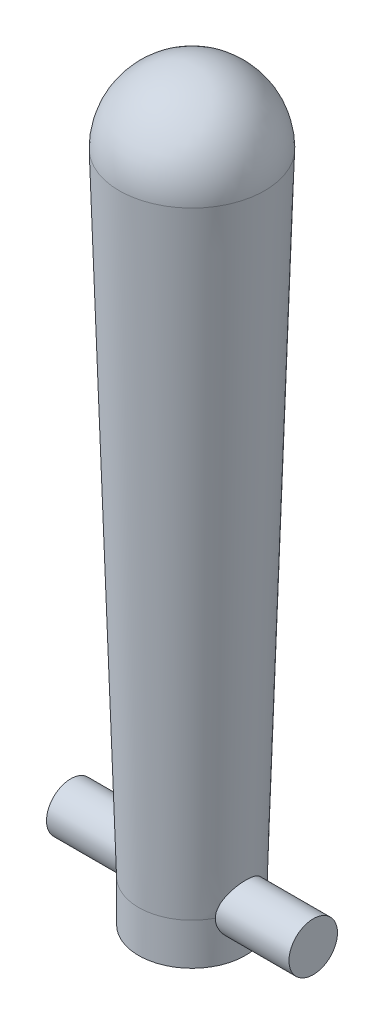
ISO-10303-21;
HEADER;
FILE_DESCRIPTION(('STEP AP214'),'2;1');
FILE_NAME('part.step','',(''),(''),'','','');
FILE_SCHEMA(('AUTOMOTIVE_DESIGN { 1 0 10303 214 1 1 1 1 }'));
ENDSEC;
DATA;
#1=APPLICATION_CONTEXT('core data for automotive mechanical design processes');
#2=APPLICATION_PROTOCOL_DEFINITION('international standard','automotive_design',2000,#1);
#3=PRODUCT_CONTEXT('',#1,'mechanical');
#4=PRODUCT('Part','Part','',(#3));
#5=PRODUCT_RELATED_PRODUCT_CATEGORY('part','',(#4));
#6=PRODUCT_DEFINITION_FORMATION('','',#4);
#7=PRODUCT_DEFINITION_CONTEXT('part definition',#1,'design');
#8=PRODUCT_DEFINITION('design','',#6,#7);
#9=PRODUCT_DEFINITION_SHAPE('','',#8);
#10=(LENGTH_UNIT() NAMED_UNIT(*) SI_UNIT(.MILLI.,.METRE.));
#11=(NAMED_UNIT(*) PLANE_ANGLE_UNIT() SI_UNIT($,.RADIAN.));
#12=(NAMED_UNIT(*) SI_UNIT($,.STERADIAN.) SOLID_ANGLE_UNIT());
#13=UNCERTAINTY_MEASURE_WITH_UNIT(LENGTH_MEASURE(1.E-05),#10,'distance_accuracy_value','');
#14=(GEOMETRIC_REPRESENTATION_CONTEXT(3) GLOBAL_UNCERTAINTY_ASSIGNED_CONTEXT((#13)) GLOBAL_UNIT_ASSIGNED_CONTEXT((#10,
#11,#12)) REPRESENTATION_CONTEXT('',''));
#15=CARTESIAN_POINT('',(0.,0.,0.));
#16=DIRECTION('',(0.,0.,1.));
#17=DIRECTION('',(1.,0.,0.));
#18=AXIS2_PLACEMENT_3D('',#15,#16,#17);
#19=CARTESIAN_POINT('',(-6.22505877631642E-08,10.9185095584337,7.81017844711732E-08));
#20=DIRECTION('',(0.,1.,0.));
#21=DIRECTION('',(0.,0.,1.));
#22=AXIS2_PLACEMENT_3D('',#19,#20,#21);
#23=CONICAL_SURFACE('',#22,0.960225,0.0307595260704692);
#24=CARTESIAN_POINT('',(-6.22505877631642E-08,2.59655955843367,7.81017844711732E-08));
#25=DIRECTION('',(0.,-1.,0.));
#26=DIRECTION('',(0.,0.,-1.));
#27=AXIS2_PLACEMENT_3D('',#24,#25,#26);
#28=CIRCLE('',#27,0.704165);
#29=CARTESIAN_POINT('',(0.627216281286473,2.59655955843367,0.320075078101784));
#30=VERTEX_POINT('',#29);
#31=CARTESIAN_POINT('',(-0.627216405787648,2.59655955843367,0.320075078101784));
#32=VERTEX_POINT('',#31);
#33=EDGE_CURVE('E78',#30,#32,#28,.T.);
#34=ORIENTED_EDGE('',*,*,#33,.F.);
#35=CARTESIAN_POINT('',(0.627211871671005,2.59643152843367,0.320075052495783));
#36=CARTESIAN_POINT('',(0.627774260262814,2.61363465105871,0.320099552192788));
#37=CARTESIAN_POINT('',(0.629098649276304,2.63077906961744,0.318703553345958));
#38=CARTESIAN_POINT('',(0.632992881290255,2.66440966394063,0.3132569308774));
#39=CARTESIAN_POINT('',(0.6355563517057,2.68089874556348,0.309219853156604));
#40=CARTESIAN_POINT('',(0.641655637089719,2.71283195187365,0.298684088615112));
#41=CARTESIAN_POINT('',(0.645189606088225,2.72827799171024,0.292190066340817));
#42=CARTESIAN_POINT('',(0.652865116590407,2.75787300794719,0.276953603035148));
#43=CARTESIAN_POINT('',(0.657007482598257,2.77202018115153,0.268208098474659));
#44=CARTESIAN_POINT('',(0.665835773717179,2.79973277554323,0.247960557265956));
#45=CARTESIAN_POINT('',(0.670539281227394,2.81317937673072,0.236303363146492));
#46=CARTESIAN_POINT('',(0.679760961910614,2.837993430705,0.210886729318048));
#47=CARTESIAN_POINT('',(0.684279102294035,2.84936051686603,0.197126919693922));
#48=CARTESIAN_POINT('',(0.692887052564143,2.87016319533712,0.167140717043652));
#49=CARTESIAN_POINT('',(0.696949981974717,2.87949433035392,0.150833533178759));
#50=CARTESIAN_POINT('',(0.703969785723909,2.89521771887439,0.116639396022319));
#51=CARTESIAN_POINT('',(0.706927369323864,2.90161185755022,0.0987534648978867));
#52=CARTESIAN_POINT('',(0.711227918885548,2.910803772369,0.0633139510704268));
#53=CARTESIAN_POINT('',(0.712673616046592,2.9138314158939,0.0458326320356412));
#54=CARTESIAN_POINT('',(0.714162912113332,2.91694953406082,0.0105537770509313));
#55=CARTESIAN_POINT('',(0.714207200699864,2.91704145347276,-0.00724359904143412));
#56=CARTESIAN_POINT('',(0.712941544185585,2.91439287449274,-0.0412068880387886));
#57=CARTESIAN_POINT('',(0.711734201579422,2.91186697620494,-0.0573940450251657));
#58=CARTESIAN_POINT('',(0.708235167080418,2.90441880332078,-0.0890821895783392));
#59=CARTESIAN_POINT('',(0.705943400659326,2.89949636401876,-0.104583129904038));
#60=CARTESIAN_POINT('',(0.700424851688911,2.88732539974184,-0.134810298937162));
#61=CARTESIAN_POINT('',(0.697181192990191,2.88003461210937,-0.149516311624252));
#62=CARTESIAN_POINT('',(0.690050065523073,2.86338467026965,-0.177533605587768));
#63=CARTESIAN_POINT('',(0.686162359077817,2.85402475205052,-0.190844368994942));
#64=CARTESIAN_POINT('',(0.677690828906097,2.83255013563128,-0.216948905545537));
#65=CARTESIAN_POINT('',(0.673075847429007,2.82026482366496,-0.229592344395767));
#66=CARTESIAN_POINT('',(0.663869909368219,2.79377632657206,-0.252710997931971));
#67=CARTESIAN_POINT('',(0.659278974428788,2.77957164707739,-0.263184506910181));
#68=CARTESIAN_POINT('',(0.650325248994902,2.74867726079237,-0.282233555562714));
#69=CARTESIAN_POINT('',(0.645989847759086,2.73189267985328,-0.29066907117176));
#70=CARTESIAN_POINT('',(0.638388394290289,2.6969122209401,-0.304514979207038));
#71=CARTESIAN_POINT('',(0.635120037291172,2.67871949114909,-0.309931909781299));
#72=CARTESIAN_POINT('',(0.631205278144744,2.64968457110141,-0.31581496207397));
#73=CARTESIAN_POINT('',(0.63003797606326,2.63913046999313,-0.317410726472569));
#74=CARTESIAN_POINT('',(0.628223365730673,2.61786762534993,-0.319543981359214));
#75=CARTESIAN_POINT('',(0.627576280210204,2.60715881757274,-0.320081018696193));
#76=CARTESIAN_POINT('',(0.627211871671005,2.59643152843367,-0.320074896292215));
#77=B_SPLINE_CURVE_WITH_KNOTS('',3,(#35,#36,#37,#38,#39,#40,#41,#42,#43,#44,#45,#46,#47,#48,#49,
#50,#51,#52,#53,#54,#55,#56,#57,#58,#59,#60,#61,#62,#63,#64,#65,#66,#67,#68,#69,#70,#71,#72,#73,
#74,#75,#76),.UNSPECIFIED.,.F.,.F.,(4,2,2,2,2,2,2,2,2,2,2,2,2,2,2,2,2,2,2,2,4),(0.,
0.0515129943056462,0.102763831996349,0.153917853518652,0.205141850195332,0.260123773753569,
0.315115381494372,0.372478908428164,0.429805563759261,0.482917037942269,0.53600237375521,
0.585055723864567,0.634112445710562,0.684097668854055,0.734101379609087,0.788536114558833,
0.843013477794551,0.900557396391122,0.957976187573991,0.99012929129155,1.02229615403462),.UNSPECIFIED.);
#78=CARTESIAN_POINT('',(0.627216281286473,2.59655955843367,-0.320074921898216));
#79=VERTEX_POINT('',#78);
#80=EDGE_CURVE('E63',#30,#79,#77,.T.);
#81=ORIENTED_EDGE('',*,*,#80,.T.);
#82=CARTESIAN_POINT('',(-0.627216405787648,2.59655955843367,-0.320074921898216));
#83=VERTEX_POINT('',#82);
#84=EDGE_CURVE('E77',#83,#79,#28,.T.);
#85=ORIENTED_EDGE('',*,*,#84,.F.);
#86=CARTESIAN_POINT('',(-0.62721199617218,2.59643152843367,-0.320074896292214));
#87=CARTESIAN_POINT('',(-0.627774384763989,2.61363465105871,-0.320099395989219));
#88=CARTESIAN_POINT('',(-0.629098773777479,2.63077906961744,-0.318703397142389));
#89=CARTESIAN_POINT('',(-0.632993005791431,2.66440966394063,-0.313256774673831));
#90=CARTESIAN_POINT('',(-0.635556476206876,2.68089874556348,-0.309219696953035));
#91=CARTESIAN_POINT('',(-0.641655761590895,2.71283195187365,-0.298683932411543));
#92=CARTESIAN_POINT('',(-0.6451897305894,2.72827799171024,-0.292189910137248));
#93=CARTESIAN_POINT('',(-0.652865241091582,2.75787300794719,-0.276953446831579));
#94=CARTESIAN_POINT('',(-0.657007607099433,2.77202018115153,-0.26820794227109));
#95=CARTESIAN_POINT('',(-0.665835898218355,2.79973277554323,-0.247960401062387));
#96=CARTESIAN_POINT('',(-0.67053940572857,2.81317937673072,-0.236303206942923));
#97=CARTESIAN_POINT('',(-0.679761086411789,2.837993430705,-0.210886573114479));
#98=CARTESIAN_POINT('',(-0.684279226795211,2.84936051686603,-0.197126763490353));
#99=CARTESIAN_POINT('',(-0.692887177065319,2.87016319533712,-0.167140560840083));
#100=CARTESIAN_POINT('',(-0.696950106475892,2.87949433035392,-0.15083337697519));
#101=CARTESIAN_POINT('',(-0.703969910225084,2.89521771887439,-0.116639239818751));
#102=CARTESIAN_POINT('',(-0.706927493825039,2.90161185755022,-0.0987533086943177));
#103=CARTESIAN_POINT('',(-0.711228043386724,2.910803772369,-0.0633137948668579));
#104=CARTESIAN_POINT('',(-0.712673740547768,2.9138314158939,-0.0458324758320723));
#105=CARTESIAN_POINT('',(-0.714163036614507,2.91694953406082,-0.0105536208473624));
#106=CARTESIAN_POINT('',(-0.71420732520104,2.91704145347276,0.00724375524500307));
#107=CARTESIAN_POINT('',(-0.712941668686761,2.91439287449274,0.0412070442423576));
#108=CARTESIAN_POINT('',(-0.711734326080598,2.91186697620494,0.0573942012287346));
#109=CARTESIAN_POINT('',(-0.708235291581594,2.90441880332078,0.0890823457819082));
#110=CARTESIAN_POINT('',(-0.705943525160501,2.89949636401876,0.104583286107607));
#111=CARTESIAN_POINT('',(-0.700424976190086,2.88732539974184,0.134810455140731));
#112=CARTESIAN_POINT('',(-0.697181317491366,2.88003461210937,0.149516467827821));
#113=CARTESIAN_POINT('',(-0.690050190024248,2.86338467026965,0.177533761791337));
#114=CARTESIAN_POINT('',(-0.686162483578992,2.85402475205052,0.190844525198511));
#115=CARTESIAN_POINT('',(-0.677690953407273,2.83255013563128,0.216949061749106));
#116=CARTESIAN_POINT('',(-0.673075971930182,2.82026482366496,0.229592500599336));
#117=CARTESIAN_POINT('',(-0.663870033869394,2.79377632657206,0.25271115413554));
#118=CARTESIAN_POINT('',(-0.659279098929964,2.77957164707739,0.26318466311375));
#119=CARTESIAN_POINT('',(-0.650325373496077,2.74867726079237,0.282233711766283));
#120=CARTESIAN_POINT('',(-0.645989972260261,2.73189267985328,0.290669227375329));
#121=CARTESIAN_POINT('',(-0.638388518791465,2.6969122209401,0.304515135410607));
#122=CARTESIAN_POINT('',(-0.635120161792348,2.67871949114909,0.309932065984868));
#123=CARTESIAN_POINT('',(-0.631205402645919,2.64968457110141,0.315815118277539));
#124=CARTESIAN_POINT('',(-0.630038100564436,2.63913046999313,0.317410882676138));
#125=CARTESIAN_POINT('',(-0.628223490231848,2.61786762534993,0.319544137562783));
#126=CARTESIAN_POINT('',(-0.627576404711379,2.60715881757274,0.320081174899762));
#127=CARTESIAN_POINT('',(-0.62721199617218,2.59643152843367,0.320075052495783));
#128=B_SPLINE_CURVE_WITH_KNOTS('',3,(#86,#87,#88,#89,#90,#91,#92,#93,#94,#95,#96,#97,#98,#99,
#100,#101,#102,#103,#104,#105,#106,#107,#108,#109,#110,#111,#112,#113,#114,#115,#116,#117,#118,
#119,#120,#121,#122,#123,#124,#125,#126,#127),.UNSPECIFIED.,.F.,.F.,(4,2,2,2,2,2,2,2,2,2,2,2,2,
2,2,2,2,2,2,2,4),(0.,0.0515129943056462,0.102763831996349,0.153917853518652,0.205141850195333,
0.260123773753569,0.315115381494372,0.372478908428164,0.429805563759261,0.482917037942269,
0.53600237375521,0.585055723864567,0.634112445710561,0.684097668854055,0.734101379609087,
0.788536114558833,0.843013477794551,0.900557396391123,0.957976187573991,0.990129291291551,
1.02229615403462),.UNSPECIFIED.);
#129=EDGE_CURVE('E57',#83,#32,#128,.T.);
#130=ORIENTED_EDGE('',*,*,#129,.T.);
#131=EDGE_LOOP('',(#34,#81,#85,#130));
#132=FACE_BOUND('',#131,.T.);
#133=CARTESIAN_POINT('',(-6.22505877631642E-08,10.9185095584337,7.81017844711732E-08));
#134=DIRECTION('',(0.,-1.,0.));
#135=DIRECTION('',(0.,0.,-1.));
#136=AXIS2_PLACEMENT_3D('',#133,#134,#135);
#137=CIRCLE('',#136,0.960225);
#138=CARTESIAN_POINT('',(-6.22505877631642E-08,10.9185095584337,-0.960224921898215));
#139=VERTEX_POINT('',#138);
#140=EDGE_CURVE('E73',#139,#139,#137,.T.);
#141=ORIENTED_EDGE('',*,*,#140,.T.);
#142=EDGE_LOOP('',(#141));
#143=FACE_BOUND('',#142,.T.);
#144=ADVANCED_FACE('F38',(#132,#143),#23,.T.);
#145=CARTESIAN_POINT('',(-6.22505877631642E-08,10.9185095584337,7.81017844711732E-08));
#146=DIRECTION('',(0.,-1.,0.));
#147=DIRECTION('',(0.,0.,-1.));
#148=AXIS2_PLACEMENT_3D('',#145,#146,#147);
#149=SPHERICAL_SURFACE('',#148,0.960225);
#150=ORIENTED_EDGE('',*,*,#140,.F.);
#151=EDGE_LOOP('',(#150));
#152=FACE_BOUND('',#151,.T.);
#153=ADVANCED_FACE('F126',(#152),#149,.T.);
#154=CARTESIAN_POINT('',(-6.22505877631642E-08,2.04741952973679,7.81017844711732E-08));
#155=DIRECTION('',(0.,1.,0.));
#156=DIRECTION('',(0.,0.,1.));
#157=AXIS2_PLACEMENT_3D('',#154,#155,#156);
#158=PLANE('',#157);
#159=CARTESIAN_POINT('',(-6.22505877631642E-08,2.04741952973679,7.81017844711732E-08));
#160=DIRECTION('',(0.,-1.,0.));
#161=DIRECTION('',(0.,0.,-1.));
#162=AXIS2_PLACEMENT_3D('',#159,#160,#161);
#163=CIRCLE('',#162,0.704165);
#164=CARTESIAN_POINT('',(-6.22505877631642E-08,2.04741952973679,-0.704164921898216));
#165=VERTEX_POINT('',#164);
#166=EDGE_CURVE('E83',#165,#165,#163,.T.);
#167=ORIENTED_EDGE('',*,*,#166,.T.);
#168=EDGE_LOOP('',(#167));
#169=FACE_BOUND('',#168,.T.);
#170=ADVANCED_FACE('F130',(#169),#158,.F.);
#171=CARTESIAN_POINT('',(-6.22505877631642E-08,2.59655955843367,7.81017844711732E-08));
#172=DIRECTION('',(0.,-1.,0.));
#173=DIRECTION('',(0.,0.,-1.));
#174=AXIS2_PLACEMENT_3D('',#171,#172,#173);
#175=CYLINDRICAL_SURFACE('',#174,0.704165);
#176=ORIENTED_EDGE('',*,*,#166,.F.);
#177=EDGE_LOOP('',(#176));
#178=FACE_BOUND('',#177,.T.);
#179=ORIENTED_EDGE('',*,*,#33,.T.);
#180=CARTESIAN_POINT('',(-0.627216405787648,2.59655955843367,-0.320074921898216));
#181=CARTESIAN_POINT('',(-0.627218648572462,2.61346526175109,-0.32007275974522));
#182=CARTESIAN_POINT('',(-0.627909962073387,2.63039112163022,-0.318727150124534));
#183=CARTESIAN_POINT('',(-0.630583561106963,2.66374421927839,-0.313402230274501));
#184=CARTESIAN_POINT('',(-0.632569026032251,2.68017012448957,-0.309416433400727));
#185=CARTESIAN_POINT('',(-0.637554353522433,2.71197592411691,-0.299007858517528));
#186=CARTESIAN_POINT('',(-0.640549537931007,2.72736025652369,-0.292596302893692));
#187=CARTESIAN_POINT('',(-0.647210089349772,2.75683130823579,-0.277551637916824));
#188=CARTESIAN_POINT('',(-0.650875385367387,2.77091816476003,-0.268918763853988));
#189=CARTESIAN_POINT('',(-0.658767232549814,2.79844935254623,-0.2489907149089));
#190=CARTESIAN_POINT('',(-0.663014972047232,2.81178599121482,-0.237555086586052));
#191=CARTESIAN_POINT('',(-0.67142052750926,2.8364335584733,-0.212639846767605));
#192=CARTESIAN_POINT('',(-0.675578304067077,2.84774361453756,-0.199159359467857));
#193=CARTESIAN_POINT('',(-0.683601508636945,2.86860425054998,-0.169655554015999));
#194=CARTESIAN_POINT('',(-0.687439497490303,2.87802873763064,-0.153534931691296));
#195=CARTESIAN_POINT('',(-0.694124719164096,2.89398412946575,-0.119730440417821));
#196=CARTESIAN_POINT('',(-0.696972471262083,2.90051655130411,-0.102047396918611));
#197=CARTESIAN_POINT('',(-0.701205110126104,2.91009662133226,-0.0667553435082816));
#198=CARTESIAN_POINT('',(-0.702668131576687,2.91333132010413,-0.0492066802331819));
#199=CARTESIAN_POINT('',(-0.704253701724381,2.91683357856047,-0.0137589857308948));
#200=CARTESIAN_POINT('',(-0.704376905774988,2.91710258887209,0.00413986991187788));
#201=CARTESIAN_POINT('',(-0.703311149308117,2.91475277005711,0.0384001367074892));
#202=CARTESIAN_POINT('',(-0.702216256486469,2.91234097824565,0.0547792704027349));
#203=CARTESIAN_POINT('',(-0.69897220600413,2.90505963930326,0.0868705607719003));
#204=CARTESIAN_POINT('',(-0.696822970169304,2.90018990992808,0.102582667895342));
#205=CARTESIAN_POINT('',(-0.691632188142397,2.88808130376414,0.133184470113301));
#206=CARTESIAN_POINT('',(-0.688577632460642,2.88080769430825,0.148058124044225));
#207=CARTESIAN_POINT('',(-0.681864841131401,2.86413645435912,0.176412611660638));
#208=CARTESIAN_POINT('',(-0.678206384505963,2.85473804589762,0.189892932553968));
#209=CARTESIAN_POINT('',(-0.670290689987765,2.83319747000346,0.216248243835898));
#210=CARTESIAN_POINT('',(-0.6660089517247,2.82089407084774,0.228984263075549));
#211=CARTESIAN_POINT('',(-0.657539039280084,2.79433591791504,0.252279266493828));
#212=CARTESIAN_POINT('',(-0.653350916974307,2.78008011196891,0.262837069070236));
#213=CARTESIAN_POINT('',(-0.645348025989356,2.7492199827287,0.281933678455032));
#214=CARTESIAN_POINT('',(-0.641558696897339,2.73253862106137,0.290359626978342));
#215=CARTESIAN_POINT('',(-0.635102600685578,2.69777743129452,0.304224112486146));
#216=CARTESIAN_POINT('',(-0.632434858016001,2.67969883477546,0.309665246906835));
#217=CARTESIAN_POINT('',(-0.628780574747675,2.64405146486967,0.317016169307517));
#218=CARTESIAN_POINT('',(-0.627685999650005,2.62654103210591,0.319153739425071));
#219=CARTESIAN_POINT('',(-0.626991995631092,2.59138118094992,0.320515729198698));
#220=CARTESIAN_POINT('',(-0.627391860415002,2.5737318321463,0.319741525002171));
#221=CARTESIAN_POINT('',(-0.629528489364504,2.54033690799739,0.315510610650661));
#222=CARTESIAN_POINT('',(-0.631152264137526,2.52455437826224,0.31228042380779));
#223=CARTESIAN_POINT('',(-0.635399388766135,2.49377512903669,0.303544882060718));
#224=CARTESIAN_POINT('',(-0.63802300441556,2.47877861970581,0.298038922140838));
#225=CARTESIAN_POINT('',(-0.644117393678624,2.44923153605244,0.284635920823006));
#226=CARTESIAN_POINT('',(-0.647621215952266,2.43473210367152,0.276641687338105));
#227=CARTESIAN_POINT('',(-0.655042093341514,2.40720329071674,0.258579933128693));
#228=CARTESIAN_POINT('',(-0.658959347180871,2.39417462337828,0.248511413124964));
#229=CARTESIAN_POINT('',(-0.667238892672708,2.36859412723538,0.225401465744029));
#230=CARTESIAN_POINT('',(-0.671606427407186,2.35622107047912,0.212163184372965));
#231=CARTESIAN_POINT('',(-0.679940739097088,2.33382942248829,0.183708140445883));
#232=CARTESIAN_POINT('',(-0.683907447510285,2.32381123355443,0.168491040521335));
#233=CARTESIAN_POINT('',(-0.691058919475501,2.3063417988542,0.136240548369848));
#234=CARTESIAN_POINT('',(-0.694234450586737,2.29892048604306,0.119188761361035));
#235=CARTESIAN_POINT('',(-0.699376316631904,2.28711605278255,0.0838945472649426));
#236=CARTESIAN_POINT('',(-0.701343522709598,2.28273074323141,0.0656529884659733));
#237=CARTESIAN_POINT('',(-0.703729936438965,2.27743515812985,0.0300784672743482));
#238=CARTESIAN_POINT('',(-0.704260745314735,2.27627415543637,0.0127901377443898));
#239=CARTESIAN_POINT('',(-0.704040960217289,2.2767574856142,-0.0217368188392374));
#240=CARTESIAN_POINT('',(-0.70329067468443,2.27840114322653,-0.0389754568558763));
#241=CARTESIAN_POINT('',(-0.700656248984076,2.28426949368271,-0.0720531572531185));
#242=CARTESIAN_POINT('',(-0.698828160493676,2.28836674152078,-0.087919702918218));
#243=CARTESIAN_POINT('',(-0.694258813920409,2.29887317536704,-0.118725773746248));
#244=CARTESIAN_POINT('',(-0.691517400938004,2.30528275356102,-0.133665141149843));
#245=CARTESIAN_POINT('',(-0.685222602849866,2.32055211237846,-0.162950875340773));
#246=CARTESIAN_POINT('',(-0.681637818286347,2.32951053984592,-0.177238879351673));
#247=CARTESIAN_POINT('',(-0.674061114106485,2.34949001946169,-0.204171676798286));
#248=CARTESIAN_POINT('',(-0.670069016905711,2.3605119730514,-0.216815747983927));
#249=CARTESIAN_POINT('',(-0.661704199069244,2.38537224277917,-0.241195962303814));
#250=CARTESIAN_POINT('',(-0.657327297716244,2.39936806748158,-0.252770610571898));
#251=CARTESIAN_POINT('',(-0.648999308018663,2.42921366221543,-0.273446408779364));
#252=CARTESIAN_POINT('',(-0.645048501377084,2.44506464447978,-0.282545928319462));
#253=CARTESIAN_POINT('',(-0.63804146304906,2.47839138012343,-0.298034539279073));
#254=CARTESIAN_POINT('',(-0.634992596751186,2.49587905408373,-0.304401496300268));
#255=CARTESIAN_POINT('',(-0.630298005563438,2.53183556442172,-0.314010336284582));
#256=CARTESIAN_POINT('',(-0.62864757291757,2.55030088470851,-0.317262709191369));
#257=CARTESIAN_POINT('',(-0.627419363209699,2.57810528310192,-0.319676811977517));
#258=CARTESIAN_POINT('',(-0.627215181276503,2.58732941651324,-0.320076102386163));
#259=CARTESIAN_POINT('',(-0.627216405787648,2.59655955843367,-0.320074921898216));
#260=B_SPLINE_CURVE_WITH_KNOTS('',3,(#180,#181,#182,#183,#184,#185,#186,#187,#188,#189,#190,
#191,#192,#193,#194,#195,#196,#197,#198,#199,#200,#201,#202,#203,#204,#205,#206,#207,#208,#209,
#210,#211,#212,#213,#214,#215,#216,#217,#218,#219,#220,#221,#222,#223,#224,#225,#226,#227,#228,
#229,#230,#231,#232,#233,#234,#235,#236,#237,#238,#239,#240,#241,#242,#243,#244,#245,#246,#247,
#248,#249,#250,#251,#252,#253,#254,#255,#256,#257,#258,#259),.UNSPECIFIED.,.T.,.F.,(4,2,2,2,2,2,
2,2,2,2,2,2,2,2,2,2,2,2,2,2,2,2,2,2,2,2,2,2,2,2,2,2,2,2,2,2,2,2,2,4),(0.,0.0506869464465623,
0.10149888924898,0.152078577534297,0.202652910437465,0.256643770978819,0.310657821202866,
0.367554137928759,0.424420573220236,0.477843801330616,0.531240897018047,0.580783891633834,
0.630330560164365,0.680626919522176,0.73094172416485,0.785358927435213,0.83980557286321,
0.896713749814894,0.95357232542,1.00630119908373,1.05900515543787,1.10736202668388,
1.15573176191113,1.20629711615167,1.25688688725131,1.3125487752415,1.36822016549241,
1.42451360947527,1.48076642083167,1.53250296820907,1.58422706108739,1.63347277297908,
1.68272684118303,1.73423337740176,1.78576246672573,1.84155185617431,1.89737790630629,
1.9536479960939,2.00972789421924,2.03740185137028),.UNSPECIFIED.);
#261=EDGE_CURVE('E11',#32,#83,#260,.T.);
#262=ORIENTED_EDGE('',*,*,#261,.T.);
#263=ORIENTED_EDGE('',*,*,#84,.T.);
#264=CARTESIAN_POINT('',(0.627216281286473,2.59655955843367,-0.320074921898216));
#265=CARTESIAN_POINT('',(0.627218524071287,2.57965385511624,-0.32007275974522));
#266=CARTESIAN_POINT('',(0.627909837572212,2.56272799523711,-0.318727150124534));
#267=CARTESIAN_POINT('',(0.630583436605788,2.52937489758894,-0.313402230274501));
#268=CARTESIAN_POINT('',(0.632568901531075,2.51294899237776,-0.309416433400727));
#269=CARTESIAN_POINT('',(0.637554229021258,2.48114319275042,-0.299007858517528));
#270=CARTESIAN_POINT('',(0.640549413429832,2.46575886034364,-0.292596302893692));
#271=CARTESIAN_POINT('',(0.647209964848596,2.43628780863155,-0.277551637916825));
#272=CARTESIAN_POINT('',(0.650875260866212,2.4222009521073,-0.268918763853988));
#273=CARTESIAN_POINT('',(0.658767108048639,2.3946697643211,-0.2489907149089));
#274=CARTESIAN_POINT('',(0.663014847546057,2.38133312565251,-0.237555086586052));
#275=CARTESIAN_POINT('',(0.671420403008085,2.35668555839403,-0.212639846767605));
#276=CARTESIAN_POINT('',(0.675578179565901,2.34537550232977,-0.199159359467857));
#277=CARTESIAN_POINT('',(0.683601384135769,2.32451486631736,-0.169655554015999));
#278=CARTESIAN_POINT('',(0.687439372989127,2.31509037923669,-0.153534931691297));
#279=CARTESIAN_POINT('',(0.69412459466292,2.29913498740159,-0.119730440417821));
#280=CARTESIAN_POINT('',(0.696972346760907,2.29260256556322,-0.102047396918611));
#281=CARTESIAN_POINT('',(0.701204985624929,2.28302249553507,-0.0667553435082816));
#282=CARTESIAN_POINT('',(0.702668007075512,2.27978779676321,-0.0492066802331818));
#283=CARTESIAN_POINT('',(0.704253577223206,2.27628553830687,-0.0137589857308948));
#284=CARTESIAN_POINT('',(0.704376781273813,2.27601652799525,0.00413986991187791));
#285=CARTESIAN_POINT('',(0.703311024806942,2.27836634681022,0.0384001367074892));
#286=CARTESIAN_POINT('',(0.702216131985293,2.28077813862169,0.0547792704027348));
#287=CARTESIAN_POINT('',(0.698972081502955,2.28805947756407,0.0868705607719002));
#288=CARTESIAN_POINT('',(0.696822845668128,2.29292920693925,0.102582667895341));
#289=CARTESIAN_POINT('',(0.691632063641222,2.30503781310319,0.133184470113301));
#290=CARTESIAN_POINT('',(0.688577507959467,2.31231142255908,0.148058124044225));
#291=CARTESIAN_POINT('',(0.681864716630226,2.32898266250821,0.176412611660638));
#292=CARTESIAN_POINT('',(0.678206260004788,2.33838107096971,0.189892932553969));
#293=CARTESIAN_POINT('',(0.67029056548659,2.35992164686387,0.216248243835898));
#294=CARTESIAN_POINT('',(0.666008827223525,2.3722250460196,0.228984263075548));
#295=CARTESIAN_POINT('',(0.657538914778909,2.39878319895229,0.252279266493828));
#296=CARTESIAN_POINT('',(0.653350792473132,2.41303900489842,0.262837069070236));
#297=CARTESIAN_POINT('',(0.645347901488181,2.44389913413864,0.281933678455032));
#298=CARTESIAN_POINT('',(0.641558572396163,2.46058049580596,0.290359626978342));
#299=CARTESIAN_POINT('',(0.635102476184403,2.49534168557281,0.304224112486146));
#300=CARTESIAN_POINT('',(0.632434733514825,2.51342028209188,0.309665246906835));
#301=CARTESIAN_POINT('',(0.6287804502465,2.54906765199766,0.317016169307517));
#302=CARTESIAN_POINT('',(0.62768587514883,2.56657808476142,0.319153739425071));
#303=CARTESIAN_POINT('',(0.626991871129917,2.60173793591742,0.320515729198698));
#304=CARTESIAN_POINT('',(0.627391735913826,2.61938728472103,0.319741525002171));
#305=CARTESIAN_POINT('',(0.629528364863328,2.65278220886994,0.315510610650661));
#306=CARTESIAN_POINT('',(0.63115213963635,2.66856473860509,0.31228042380779));
#307=CARTESIAN_POINT('',(0.635399264264959,2.69934398783065,0.303544882060718));
#308=CARTESIAN_POINT('',(0.638022879914384,2.71434049716152,0.298038922140838));
#309=CARTESIAN_POINT('',(0.644117269177448,2.7438875808149,0.284635920823006));
#310=CARTESIAN_POINT('',(0.64762109145109,2.75838701319581,0.276641687338105));
#311=CARTESIAN_POINT('',(0.655041968840339,2.7859158261506,0.258579933128693));
#312=CARTESIAN_POINT('',(0.658959222679695,2.79894449348905,0.248511413124964));
#313=CARTESIAN_POINT('',(0.667238768171532,2.82452498963196,0.225401465744029));
#314=CARTESIAN_POINT('',(0.67160630290601,2.83689804638822,0.212163184372965));
#315=CARTESIAN_POINT('',(0.679940614595913,2.85928969437904,0.183708140445883));
#316=CARTESIAN_POINT('',(0.68390732300911,2.8693078833129,0.168491040521335));
#317=CARTESIAN_POINT('',(0.691058794974326,2.88677731801313,0.136240548369848));
#318=CARTESIAN_POINT('',(0.694234326085562,2.89419863082428,0.119188761361035));
#319=CARTESIAN_POINT('',(0.699376192130729,2.90600306408479,0.0838945472649424));
#320=CARTESIAN_POINT('',(0.701343398208423,2.91038837363593,0.0656529884659732));
#321=CARTESIAN_POINT('',(0.703729811937789,2.91568395873748,0.0300784672743483));
#322=CARTESIAN_POINT('',(0.704260620813559,2.91684496143097,0.0127901377443899));
#323=CARTESIAN_POINT('',(0.704040835716113,2.91636163125313,-0.0217368188392372));
#324=CARTESIAN_POINT('',(0.703290550183254,2.9147179736408,-0.0389754568558763));
#325=CARTESIAN_POINT('',(0.700656124482901,2.90884962318462,-0.0720531572531186));
#326=CARTESIAN_POINT('',(0.6988280359925,2.90475237534656,-0.087919702918218));
#327=CARTESIAN_POINT('',(0.694258689419234,2.89424594150029,-0.118725773746248));
#328=CARTESIAN_POINT('',(0.691517276436828,2.88783636330632,-0.133665141149843));
#329=CARTESIAN_POINT('',(0.68522247834869,2.87256700448888,-0.162950875340772));
#330=CARTESIAN_POINT('',(0.681637693785172,2.86360857702141,-0.177238879351673));
#331=CARTESIAN_POINT('',(0.67406098960531,2.84362909740564,-0.204171676798285));
#332=CARTESIAN_POINT('',(0.670068892404536,2.83260714381593,-0.216815747983927));
#333=CARTESIAN_POINT('',(0.661704074568068,2.80774687408816,-0.241195962303815));
#334=CARTESIAN_POINT('',(0.657327173215069,2.79375104938576,-0.252770610571898));
#335=CARTESIAN_POINT('',(0.648999183517488,2.76390545465191,-0.273446408779364));
#336=CARTESIAN_POINT('',(0.645048376875909,2.74805447238756,-0.282545928319462));
#337=CARTESIAN_POINT('',(0.638041338547884,2.7147277367439,-0.298034539279073));
#338=CARTESIAN_POINT('',(0.63499247225001,2.6972400627836,-0.304401496300268));
#339=CARTESIAN_POINT('',(0.630297881062263,2.66128355244561,-0.314010336284582));
#340=CARTESIAN_POINT('',(0.628647448416395,2.64281823215882,-0.317262709191369));
#341=CARTESIAN_POINT('',(0.627419238708523,2.61501383376541,-0.319676811977517));
#342=CARTESIAN_POINT('',(0.627215056775328,2.60578970035409,-0.320076102386163));
#343=CARTESIAN_POINT('',(0.627216281286473,2.59655955843367,-0.320074921898216));
#344=B_SPLINE_CURVE_WITH_KNOTS('',3,(#264,#265,#266,#267,#268,#269,#270,#271,#272,#273,#274,
#275,#276,#277,#278,#279,#280,#281,#282,#283,#284,#285,#286,#287,#288,#289,#290,#291,#292,#293,
#294,#295,#296,#297,#298,#299,#300,#301,#302,#303,#304,#305,#306,#307,#308,#309,#310,#311,#312,
#313,#314,#315,#316,#317,#318,#319,#320,#321,#322,#323,#324,#325,#326,#327,#328,#329,#330,#331,
#332,#333,#334,#335,#336,#337,#338,#339,#340,#341,#342,#343),.UNSPECIFIED.,.T.,.F.,(4,2,2,2,2,2,
2,2,2,2,2,2,2,2,2,2,2,2,2,2,2,2,2,2,2,2,2,2,2,2,2,2,2,2,2,2,2,2,2,4),(0.,0.0506869464465623,
0.10149888924898,0.152078577534297,0.202652910437465,0.256643770978819,0.310657821202866,
0.367554137928759,0.424420573220236,0.477843801330616,0.531240897018047,0.580783891633834,
0.630330560164365,0.680626919522177,0.730941724164851,0.785358927435212,0.83980557286321,
0.896713749814894,0.95357232542,1.00630119908373,1.05900515543787,1.10736202668388,
1.15573176191113,1.20629711615167,1.25688688725131,1.3125487752415,1.36822016549241,
1.42451360947527,1.48076642083167,1.53250296820907,1.58422706108739,1.63347277297908,
1.68272684118303,1.73423337740176,1.78576246672573,1.84155185617431,1.89737790630629,
1.9536479960939,2.00972789421924,2.03740185137028),.UNSPECIFIED.);
#345=EDGE_CURVE('E51',#79,#30,#344,.T.);
#346=ORIENTED_EDGE('',*,*,#345,.T.);
#347=EDGE_LOOP('',(#179,#262,#263,#346));
#348=FACE_BOUND('',#347,.T.);
#349=ADVANCED_FACE('F81',(#178,#348),#175,.T.);
#350=CARTESIAN_POINT('',(1.60037493774941,2.59655955843367,7.81017844711732E-08));
#351=DIRECTION('',(1.,0.,0.));
#352=DIRECTION('',(0.,0.,-1.));
#353=AXIS2_PLACEMENT_3D('',#350,#351,#352);
#354=PLANE('',#353);
#355=CARTESIAN_POINT('',(1.60037493774941,2.59655955843367,7.81017844711732E-08));
#356=DIRECTION('',(1.,0.,0.));
#357=DIRECTION('',(0.,0.,-1.));
#358=AXIS2_PLACEMENT_3D('',#355,#356,#357);
#359=CIRCLE('',#358,0.320075);
#360=CARTESIAN_POINT('',(1.60037493774941,2.59655955843367,-0.320074921898216));
#361=VERTEX_POINT('',#360);
#362=EDGE_CURVE('E115',#361,#361,#359,.T.);
#363=ORIENTED_EDGE('',*,*,#362,.T.);
#364=EDGE_LOOP('',(#363));
#365=FACE_BOUND('',#364,.T.);
#366=ADVANCED_FACE('F119',(#365),#354,.T.);
#367=CARTESIAN_POINT('',(-1.60037506225059,2.59655955843367,7.81017844711732E-08));
#368=DIRECTION('',(1.,0.,0.));
#369=DIRECTION('',(0.,0.,-1.));
#370=AXIS2_PLACEMENT_3D('',#367,#368,#369);
#371=CYLINDRICAL_SURFACE('',#370,0.320075);
#372=ORIENTED_EDGE('',*,*,#362,.F.);
#373=EDGE_LOOP('',(#372));
#374=FACE_BOUND('',#373,.T.);
#375=ORIENTED_EDGE('',*,*,#80,.F.);
#376=ORIENTED_EDGE('',*,*,#345,.F.);
#377=EDGE_LOOP('',(#375,#376));
#378=FACE_BOUND('',#377,.T.);
#379=ADVANCED_FACE('F68',(#374,#378),#371,.T.);
#380=CARTESIAN_POINT('',(-1.60037506225059,2.59655955843367,7.81017844711732E-08));
#381=DIRECTION('',(1.,0.,0.));
#382=DIRECTION('',(0.,0.,-1.));
#383=AXIS2_PLACEMENT_3D('',#380,#381,#382);
#384=CIRCLE('',#383,0.320075);
#385=CARTESIAN_POINT('',(-1.60037506225059,2.59655955843367,-0.320074921898216));
#386=VERTEX_POINT('',#385);
#387=EDGE_CURVE('E79',#386,#386,#384,.T.);
#388=ORIENTED_EDGE('',*,*,#387,.T.);
#389=EDGE_LOOP('',(#388));
#390=FACE_BOUND('',#389,.T.);
#391=ORIENTED_EDGE('',*,*,#129,.F.);
#392=ORIENTED_EDGE('',*,*,#261,.F.);
#393=EDGE_LOOP('',(#391,#392));
#394=FACE_BOUND('',#393,.T.);
#395=ADVANCED_FACE('F98',(#390,#394),#371,.T.);
#396=CARTESIAN_POINT('',(-1.60037506225059,2.59655955843367,7.81017844711732E-08));
#397=DIRECTION('',(1.,0.,0.));
#398=DIRECTION('',(0.,0.,-1.));
#399=AXIS2_PLACEMENT_3D('',#396,#397,#398);
#400=PLANE('',#399);
#401=ORIENTED_EDGE('',*,*,#387,.F.);
#402=EDGE_LOOP('',(#401));
#403=FACE_BOUND('',#402,.T.);
#404=ADVANCED_FACE('F102',(#403),#400,.F.);
#405=CLOSED_SHELL('',(#144,#153,#170,#349,#366,#379,#395,#404));
#406=MANIFOLD_SOLID_BREP('B2',#405);
#407=ADVANCED_BREP_SHAPE_REPRESENTATION('',(#18,#406),#14);
#408=SHAPE_DEFINITION_REPRESENTATION(#9,#407);
ENDSEC;
END-ISO-10303-21;
